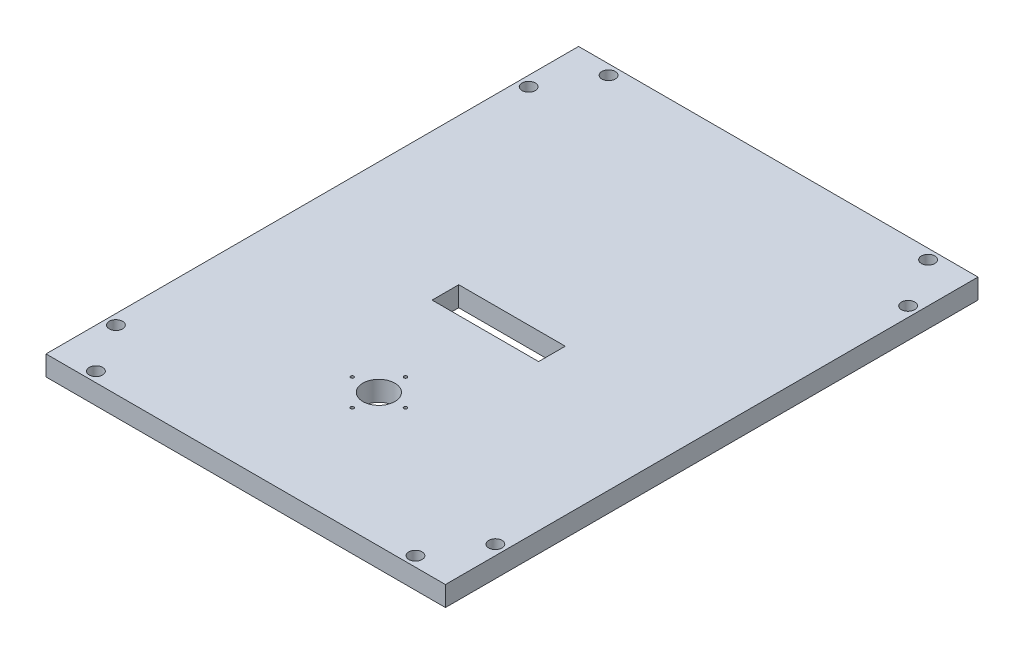
ISO-10303-21;
HEADER;
FILE_DESCRIPTION(('STEP AP214'),'2;1');
FILE_NAME('part.step','',(''),(''),'','','');
FILE_SCHEMA(('AUTOMOTIVE_DESIGN { 1 0 10303 214 1 1 1 1 }'));
ENDSEC;
DATA;
#1=APPLICATION_CONTEXT('core data for automotive mechanical design processes');
#2=APPLICATION_PROTOCOL_DEFINITION('international standard','automotive_design',2000,#1);
#3=PRODUCT_CONTEXT('',#1,'mechanical');
#4=PRODUCT('Part','Part','',(#3));
#5=PRODUCT_RELATED_PRODUCT_CATEGORY('part','',(#4));
#6=PRODUCT_DEFINITION_FORMATION('','',#4);
#7=PRODUCT_DEFINITION_CONTEXT('part definition',#1,'design');
#8=PRODUCT_DEFINITION('design','',#6,#7);
#9=PRODUCT_DEFINITION_SHAPE('','',#8);
#10=(LENGTH_UNIT() NAMED_UNIT(*) SI_UNIT(.MILLI.,.METRE.));
#11=(NAMED_UNIT(*) PLANE_ANGLE_UNIT() SI_UNIT($,.RADIAN.));
#12=(NAMED_UNIT(*) SI_UNIT($,.STERADIAN.) SOLID_ANGLE_UNIT());
#13=UNCERTAINTY_MEASURE_WITH_UNIT(LENGTH_MEASURE(1.E-05),#10,'distance_accuracy_value','');
#14=(GEOMETRIC_REPRESENTATION_CONTEXT(3) GLOBAL_UNCERTAINTY_ASSIGNED_CONTEXT((#13)) GLOBAL_UNIT_ASSIGNED_CONTEXT((#10,
#11,#12)) REPRESENTATION_CONTEXT('',''));
#15=CARTESIAN_POINT('',(0.,0.,0.));
#16=DIRECTION('',(0.,0.,1.));
#17=DIRECTION('',(1.,0.,0.));
#18=AXIS2_PLACEMENT_3D('',#15,#16,#17);
#19=CARTESIAN_POINT('',(0.,7.5,0.));
#20=DIRECTION('',(-1.,0.,0.));
#21=DIRECTION('',(0.,0.,1.));
#22=AXIS2_PLACEMENT_3D('',#19,#20,#21);
#23=PLANE('',#22);
#24=DIRECTION('',(0.,0.,-1.));
#25=VECTOR('',#24,1.);
#26=CARTESIAN_POINT('',(0.,0.,0.));
#27=LINE('',#26,#25);
#28=CARTESIAN_POINT('',(0.,0.,0.));
#29=VERTEX_POINT('',#28);
#30=CARTESIAN_POINT('',(0.,0.,-200.));
#31=VERTEX_POINT('',#30);
#32=EDGE_CURVE('E198',#29,#31,#27,.T.);
#33=ORIENTED_EDGE('',*,*,#32,.F.);
#34=DIRECTION('',(0.,-1.,0.));
#35=VECTOR('',#34,1.);
#36=CARTESIAN_POINT('',(0.,7.5,0.));
#37=LINE('',#36,#35);
#38=CARTESIAN_POINT('',(0.,7.5,0.));
#39=VERTEX_POINT('',#38);
#40=EDGE_CURVE('E11',#39,#29,#37,.T.);
#41=ORIENTED_EDGE('',*,*,#40,.F.);
#42=DIRECTION('',(0.,0.,-1.));
#43=VECTOR('',#42,1.);
#44=CARTESIAN_POINT('',(0.,7.5,0.));
#45=LINE('',#44,#43);
#46=CARTESIAN_POINT('',(0.,7.5,-200.));
#47=VERTEX_POINT('',#46);
#48=EDGE_CURVE('E136',#39,#47,#45,.T.);
#49=ORIENTED_EDGE('',*,*,#48,.T.);
#50=DIRECTION('',(0.,-1.,0.));
#51=VECTOR('',#50,1.);
#52=CARTESIAN_POINT('',(0.,7.5,-200.));
#53=LINE('',#52,#51);
#54=EDGE_CURVE('E67',#47,#31,#53,.T.);
#55=ORIENTED_EDGE('',*,*,#54,.T.);
#56=EDGE_LOOP('',(#33,#41,#49,#55));
#57=FACE_BOUND('',#56,.T.);
#58=ADVANCED_FACE('F47',(#57),#23,.T.);
#59=CARTESIAN_POINT('',(0.,7.5,0.));
#60=DIRECTION('',(0.,0.,-1.));
#61=DIRECTION('',(-1.,0.,0.));
#62=AXIS2_PLACEMENT_3D('',#59,#60,#61);
#63=PLANE('',#62);
#64=DIRECTION('',(1.,0.,0.));
#65=VECTOR('',#64,1.);
#66=CARTESIAN_POINT('',(0.,0.,0.));
#67=LINE('',#66,#65);
#68=CARTESIAN_POINT('',(150.,0.,0.));
#69=VERTEX_POINT('',#68);
#70=EDGE_CURVE('E142',#29,#69,#67,.T.);
#71=ORIENTED_EDGE('',*,*,#70,.T.);
#72=DIRECTION('',(0.,-1.,0.));
#73=VECTOR('',#72,1.);
#74=CARTESIAN_POINT('',(150.,7.5,0.));
#75=LINE('',#74,#73);
#76=CARTESIAN_POINT('',(150.,7.5,0.));
#77=VERTEX_POINT('',#76);
#78=EDGE_CURVE('E58',#77,#69,#75,.T.);
#79=ORIENTED_EDGE('',*,*,#78,.F.);
#80=DIRECTION('',(1.,0.,0.));
#81=VECTOR('',#80,1.);
#82=CARTESIAN_POINT('',(0.,7.5,0.));
#83=LINE('',#82,#81);
#84=EDGE_CURVE('E130',#39,#77,#83,.T.);
#85=ORIENTED_EDGE('',*,*,#84,.F.);
#86=ORIENTED_EDGE('',*,*,#40,.T.);
#87=EDGE_LOOP('',(#71,#79,#85,#86));
#88=FACE_BOUND('',#87,.T.);
#89=ADVANCED_FACE('F140',(#88),#63,.F.);
#90=CARTESIAN_POINT('',(150.,7.5,0.));
#91=DIRECTION('',(-1.,0.,0.));
#92=DIRECTION('',(0.,0.,1.));
#93=AXIS2_PLACEMENT_3D('',#90,#91,#92);
#94=PLANE('',#93);
#95=DIRECTION('',(0.,0.,-1.));
#96=VECTOR('',#95,1.);
#97=CARTESIAN_POINT('',(150.,0.,0.));
#98=LINE('',#97,#96);
#99=CARTESIAN_POINT('',(150.,0.,-200.));
#100=VERTEX_POINT('',#99);
#101=EDGE_CURVE('E193',#69,#100,#98,.T.);
#102=ORIENTED_EDGE('',*,*,#101,.T.);
#103=DIRECTION('',(0.,-1.,0.));
#104=VECTOR('',#103,1.);
#105=CARTESIAN_POINT('',(150.,7.5,-200.));
#106=LINE('',#105,#104);
#107=CARTESIAN_POINT('',(150.,7.5,-200.));
#108=VERTEX_POINT('',#107);
#109=EDGE_CURVE('E93',#108,#100,#106,.T.);
#110=ORIENTED_EDGE('',*,*,#109,.F.);
#111=DIRECTION('',(0.,0.,-1.));
#112=VECTOR('',#111,1.);
#113=CARTESIAN_POINT('',(150.,7.5,0.));
#114=LINE('',#113,#112);
#115=EDGE_CURVE('E121',#77,#108,#114,.T.);
#116=ORIENTED_EDGE('',*,*,#115,.F.);
#117=ORIENTED_EDGE('',*,*,#78,.T.);
#118=EDGE_LOOP('',(#102,#110,#116,#117));
#119=FACE_BOUND('',#118,.T.);
#120=ADVANCED_FACE('F123',(#119),#94,.F.);
#121=CARTESIAN_POINT('',(55.,7.5,0.));
#122=DIRECTION('',(-1.,0.,0.));
#123=DIRECTION('',(0.,0.,1.));
#124=AXIS2_PLACEMENT_3D('',#121,#122,#123);
#125=PLANE('',#124);
#126=DIRECTION('',(0.,0.,-1.));
#127=VECTOR('',#126,1.);
#128=CARTESIAN_POINT('',(55.,0.,0.));
#129=LINE('',#128,#127);
#130=CARTESIAN_POINT('',(55.,0.,-90.));
#131=VERTEX_POINT('',#130);
#132=CARTESIAN_POINT('',(55.,0.,-100.));
#133=VERTEX_POINT('',#132);
#134=EDGE_CURVE('E210',#131,#133,#129,.T.);
#135=ORIENTED_EDGE('',*,*,#134,.T.);
#136=DIRECTION('',(0.,-1.,0.));
#137=VECTOR('',#136,1.);
#138=CARTESIAN_POINT('',(55.,7.5,-100.));
#139=LINE('',#138,#137);
#140=CARTESIAN_POINT('',(55.,7.5,-100.));
#141=VERTEX_POINT('',#140);
#142=EDGE_CURVE('E51',#141,#133,#139,.T.);
#143=ORIENTED_EDGE('',*,*,#142,.F.);
#144=DIRECTION('',(0.,0.,-1.));
#145=VECTOR('',#144,1.);
#146=CARTESIAN_POINT('',(55.,7.5,0.));
#147=LINE('',#146,#145);
#148=CARTESIAN_POINT('',(55.,7.5,-90.));
#149=VERTEX_POINT('',#148);
#150=EDGE_CURVE('E172',#149,#141,#147,.T.);
#151=ORIENTED_EDGE('',*,*,#150,.F.);
#152=DIRECTION('',(0.,-1.,0.));
#153=VECTOR('',#152,1.);
#154=CARTESIAN_POINT('',(55.,7.5,-90.));
#155=LINE('',#154,#153);
#156=EDGE_CURVE('E149',#149,#131,#155,.T.);
#157=ORIENTED_EDGE('',*,*,#156,.T.);
#158=EDGE_LOOP('',(#135,#143,#151,#157));
#159=FACE_BOUND('',#158,.T.);
#160=ADVANCED_FACE('F49',(#159),#125,.F.);
#161=CARTESIAN_POINT('',(0.,7.5,-100.));
#162=DIRECTION('',(0.,0.,-1.));
#163=DIRECTION('',(-1.,0.,0.));
#164=AXIS2_PLACEMENT_3D('',#161,#162,#163);
#165=PLANE('',#164);
#166=DIRECTION('',(1.,0.,0.));
#167=VECTOR('',#166,1.);
#168=CARTESIAN_POINT('',(0.,0.,-100.));
#169=LINE('',#168,#167);
#170=CARTESIAN_POINT('',(95.,0.,-100.));
#171=VERTEX_POINT('',#170);
#172=EDGE_CURVE('E207',#133,#171,#169,.T.);
#173=ORIENTED_EDGE('',*,*,#172,.T.);
#174=DIRECTION('',(0.,-1.,0.));
#175=VECTOR('',#174,1.);
#176=CARTESIAN_POINT('',(95.,7.5,-100.));
#177=LINE('',#176,#175);
#178=CARTESIAN_POINT('',(95.,7.5,-100.));
#179=VERTEX_POINT('',#178);
#180=EDGE_CURVE('E157',#179,#171,#177,.T.);
#181=ORIENTED_EDGE('',*,*,#180,.F.);
#182=DIRECTION('',(1.,0.,0.));
#183=VECTOR('',#182,1.);
#184=CARTESIAN_POINT('',(0.,7.5,-100.));
#185=LINE('',#184,#183);
#186=EDGE_CURVE('E106',#141,#179,#185,.T.);
#187=ORIENTED_EDGE('',*,*,#186,.F.);
#188=ORIENTED_EDGE('',*,*,#142,.T.);
#189=EDGE_LOOP('',(#173,#181,#187,#188));
#190=FACE_BOUND('',#189,.T.);
#191=ADVANCED_FACE('F365',(#190),#165,.F.);
#192=CARTESIAN_POINT('',(95.,7.5,0.));
#193=DIRECTION('',(1.,0.,0.));
#194=DIRECTION('',(0.,0.,-1.));
#195=AXIS2_PLACEMENT_3D('',#192,#193,#194);
#196=PLANE('',#195);
#197=DIRECTION('',(0.,0.,1.));
#198=VECTOR('',#197,1.);
#199=CARTESIAN_POINT('',(95.,0.,0.));
#200=LINE('',#199,#198);
#201=CARTESIAN_POINT('',(95.,0.,-90.));
#202=VERTEX_POINT('',#201);
#203=EDGE_CURVE('E204',#171,#202,#200,.T.);
#204=ORIENTED_EDGE('',*,*,#203,.T.);
#205=DIRECTION('',(0.,-1.,0.));
#206=VECTOR('',#205,1.);
#207=CARTESIAN_POINT('',(95.,7.5,-90.));
#208=LINE('',#207,#206);
#209=CARTESIAN_POINT('',(95.,7.5,-90.));
#210=VERTEX_POINT('',#209);
#211=EDGE_CURVE('E153',#210,#202,#208,.T.);
#212=ORIENTED_EDGE('',*,*,#211,.F.);
#213=DIRECTION('',(0.,0.,1.));
#214=VECTOR('',#213,1.);
#215=CARTESIAN_POINT('',(95.,7.5,0.));
#216=LINE('',#215,#214);
#217=EDGE_CURVE('E240',#179,#210,#216,.T.);
#218=ORIENTED_EDGE('',*,*,#217,.F.);
#219=ORIENTED_EDGE('',*,*,#180,.T.);
#220=EDGE_LOOP('',(#204,#212,#218,#219));
#221=FACE_BOUND('',#220,.T.);
#222=ADVANCED_FACE('F362',(#221),#196,.F.);
#223=CARTESIAN_POINT('',(85.,7.5,-50.));
#224=DIRECTION('',(0.,-1.,0.));
#225=DIRECTION('',(0.,0.,-1.));
#226=AXIS2_PLACEMENT_3D('',#223,#224,#225);
#227=CYLINDRICAL_SURFACE('',#226,0.600000000000008);
#228=CARTESIAN_POINT('',(85.,7.5,-50.));
#229=DIRECTION('',(0.,1.,0.));
#230=DIRECTION('',(0.,0.,1.));
#231=AXIS2_PLACEMENT_3D('',#228,#229,#230);
#232=CIRCLE('',#231,0.600000000000008);
#233=CARTESIAN_POINT('',(85.,7.5,-49.4));
#234=VERTEX_POINT('',#233);
#235=EDGE_CURVE('E217',#234,#234,#232,.T.);
#236=ORIENTED_EDGE('',*,*,#235,.T.);
#237=EDGE_LOOP('',(#236));
#238=FACE_BOUND('',#237,.T.);
#239=CARTESIAN_POINT('',(85.,0.,-50.));
#240=DIRECTION('',(0.,1.,0.));
#241=DIRECTION('',(0.,0.,1.));
#242=AXIS2_PLACEMENT_3D('',#239,#240,#241);
#243=CIRCLE('',#242,0.600000000000008);
#244=CARTESIAN_POINT('',(85.,0.,-49.4));
#245=VERTEX_POINT('',#244);
#246=EDGE_CURVE('E173',#245,#245,#243,.T.);
#247=ORIENTED_EDGE('',*,*,#246,.F.);
#248=EDGE_LOOP('',(#247));
#249=FACE_BOUND('',#248,.T.);
#250=ADVANCED_FACE('F364',(#238,#249),#227,.F.);
#251=CARTESIAN_POINT('',(75.,7.5,-40.));
#252=DIRECTION('',(0.,-1.,0.));
#253=DIRECTION('',(0.,0.,-1.));
#254=AXIS2_PLACEMENT_3D('',#251,#252,#253);
#255=CYLINDRICAL_SURFACE('',#254,0.600000000000008);
#256=CARTESIAN_POINT('',(75.,7.5,-40.));
#257=DIRECTION('',(0.,1.,0.));
#258=DIRECTION('',(0.,0.,1.));
#259=AXIS2_PLACEMENT_3D('',#256,#257,#258);
#260=CIRCLE('',#259,0.600000000000008);
#261=CARTESIAN_POINT('',(75.,7.5,-39.4));
#262=VERTEX_POINT('',#261);
#263=EDGE_CURVE('E221',#262,#262,#260,.T.);
#264=ORIENTED_EDGE('',*,*,#263,.T.);
#265=EDGE_LOOP('',(#264));
#266=FACE_BOUND('',#265,.T.);
#267=CARTESIAN_POINT('',(75.,0.,-40.));
#268=DIRECTION('',(0.,1.,0.));
#269=DIRECTION('',(0.,0.,1.));
#270=AXIS2_PLACEMENT_3D('',#267,#268,#269);
#271=CIRCLE('',#270,0.600000000000008);
#272=CARTESIAN_POINT('',(75.,0.,-39.4));
#273=VERTEX_POINT('',#272);
#274=EDGE_CURVE('E177',#273,#273,#271,.T.);
#275=ORIENTED_EDGE('',*,*,#274,.F.);
#276=EDGE_LOOP('',(#275));
#277=FACE_BOUND('',#276,.T.);
#278=ADVANCED_FACE('F391',(#266,#277),#255,.F.);
#279=CARTESIAN_POINT('',(65.,7.5,-50.0000000000001));
#280=DIRECTION('',(0.,-1.,0.));
#281=DIRECTION('',(0.,0.,-1.));
#282=AXIS2_PLACEMENT_3D('',#279,#280,#281);
#283=CYLINDRICAL_SURFACE('',#282,0.600000000000008);
#284=CARTESIAN_POINT('',(65.,7.5,-50.0000000000001));
#285=DIRECTION('',(0.,1.,0.));
#286=DIRECTION('',(0.,0.,1.));
#287=AXIS2_PLACEMENT_3D('',#284,#285,#286);
#288=CIRCLE('',#287,0.600000000000008);
#289=CARTESIAN_POINT('',(65.,7.5,-49.4000000000001));
#290=VERTEX_POINT('',#289);
#291=EDGE_CURVE('E225',#290,#290,#288,.T.);
#292=ORIENTED_EDGE('',*,*,#291,.T.);
#293=EDGE_LOOP('',(#292));
#294=FACE_BOUND('',#293,.T.);
#295=CARTESIAN_POINT('',(65.,0.,-50.0000000000001));
#296=DIRECTION('',(0.,1.,0.));
#297=DIRECTION('',(0.,0.,1.));
#298=AXIS2_PLACEMENT_3D('',#295,#296,#297);
#299=CIRCLE('',#298,0.600000000000008);
#300=CARTESIAN_POINT('',(65.,0.,-49.4000000000001));
#301=VERTEX_POINT('',#300);
#302=EDGE_CURVE('E181',#301,#301,#299,.T.);
#303=ORIENTED_EDGE('',*,*,#302,.F.);
#304=EDGE_LOOP('',(#303));
#305=FACE_BOUND('',#304,.T.);
#306=ADVANCED_FACE('F387',(#294,#305),#283,.F.);
#307=CARTESIAN_POINT('',(75.0000000000001,7.5,-60.));
#308=DIRECTION('',(0.,-1.,0.));
#309=DIRECTION('',(0.,0.,-1.));
#310=AXIS2_PLACEMENT_3D('',#307,#308,#309);
#311=CYLINDRICAL_SURFACE('',#310,0.600000000000008);
#312=CARTESIAN_POINT('',(75.0000000000001,7.5,-60.));
#313=DIRECTION('',(0.,1.,0.));
#314=DIRECTION('',(0.,0.,1.));
#315=AXIS2_PLACEMENT_3D('',#312,#313,#314);
#316=CIRCLE('',#315,0.600000000000008);
#317=CARTESIAN_POINT('',(75.0000000000001,7.5,-59.4));
#318=VERTEX_POINT('',#317);
#319=EDGE_CURVE('E229',#318,#318,#316,.T.);
#320=ORIENTED_EDGE('',*,*,#319,.T.);
#321=EDGE_LOOP('',(#320));
#322=FACE_BOUND('',#321,.T.);
#323=CARTESIAN_POINT('',(75.0000000000001,0.,-60.));
#324=DIRECTION('',(0.,1.,0.));
#325=DIRECTION('',(0.,0.,1.));
#326=AXIS2_PLACEMENT_3D('',#323,#324,#325);
#327=CIRCLE('',#326,0.600000000000008);
#328=CARTESIAN_POINT('',(75.0000000000001,0.,-59.4));
#329=VERTEX_POINT('',#328);
#330=EDGE_CURVE('E185',#329,#329,#327,.T.);
#331=ORIENTED_EDGE('',*,*,#330,.F.);
#332=EDGE_LOOP('',(#331));
#333=FACE_BOUND('',#332,.T.);
#334=ADVANCED_FACE('F384',(#322,#333),#311,.F.);
#335=CARTESIAN_POINT('',(0.,7.5,-200.));
#336=DIRECTION('',(0.,0.,-1.));
#337=DIRECTION('',(-1.,0.,0.));
#338=AXIS2_PLACEMENT_3D('',#335,#336,#337);
#339=PLANE('',#338);
#340=DIRECTION('',(1.,0.,0.));
#341=VECTOR('',#340,1.);
#342=CARTESIAN_POINT('',(0.,0.,-200.));
#343=LINE('',#342,#341);
#344=EDGE_CURVE('E189',#31,#100,#343,.T.);
#345=ORIENTED_EDGE('',*,*,#344,.F.);
#346=ORIENTED_EDGE('',*,*,#54,.F.);
#347=DIRECTION('',(1.,0.,0.));
#348=VECTOR('',#347,1.);
#349=CARTESIAN_POINT('',(0.,7.5,-200.));
#350=LINE('',#349,#348);
#351=EDGE_CURVE('E129',#47,#108,#350,.T.);
#352=ORIENTED_EDGE('',*,*,#351,.T.);
#353=ORIENTED_EDGE('',*,*,#109,.T.);
#354=EDGE_LOOP('',(#345,#346,#352,#353));
#355=FACE_BOUND('',#354,.T.);
#356=ADVANCED_FACE('F350',(#355),#339,.T.);
#357=CARTESIAN_POINT('',(0.,7.5,-90.));
#358=DIRECTION('',(0.,0.,1.));
#359=DIRECTION('',(1.,0.,0.));
#360=AXIS2_PLACEMENT_3D('',#357,#358,#359);
#361=PLANE('',#360);
#362=DIRECTION('',(-1.,0.,0.));
#363=VECTOR('',#362,1.);
#364=CARTESIAN_POINT('',(0.,0.,-90.));
#365=LINE('',#364,#363);
#366=EDGE_CURVE('E201',#202,#131,#365,.T.);
#367=ORIENTED_EDGE('',*,*,#366,.T.);
#368=ORIENTED_EDGE('',*,*,#156,.F.);
#369=DIRECTION('',(-1.,0.,0.));
#370=VECTOR('',#369,1.);
#371=CARTESIAN_POINT('',(0.,7.5,-90.));
#372=LINE('',#371,#370);
#373=EDGE_CURVE('E237',#210,#149,#372,.T.);
#374=ORIENTED_EDGE('',*,*,#373,.F.);
#375=ORIENTED_EDGE('',*,*,#211,.T.);
#376=EDGE_LOOP('',(#367,#368,#374,#375));
#377=FACE_BOUND('',#376,.T.);
#378=ADVANCED_FACE('F341',(#377),#361,.F.);
#379=CARTESIAN_POINT('',(75.,7.5,-50.));
#380=DIRECTION('',(0.,-1.,0.));
#381=DIRECTION('',(0.,0.,-1.));
#382=AXIS2_PLACEMENT_3D('',#379,#380,#381);
#383=CYLINDRICAL_SURFACE('',#382,6.);
#384=CARTESIAN_POINT('',(75.,7.5,-50.));
#385=DIRECTION('',(0.,1.,0.));
#386=DIRECTION('',(0.,0.,1.));
#387=AXIS2_PLACEMENT_3D('',#384,#385,#386);
#388=CIRCLE('',#387,6.);
#389=CARTESIAN_POINT('',(75.,7.5,-44.));
#390=VERTEX_POINT('',#389);
#391=EDGE_CURVE('E154',#390,#390,#388,.T.);
#392=ORIENTED_EDGE('',*,*,#391,.T.);
#393=EDGE_LOOP('',(#392));
#394=FACE_BOUND('',#393,.T.);
#395=CARTESIAN_POINT('',(75.,0.,-50.));
#396=DIRECTION('',(0.,1.,0.));
#397=DIRECTION('',(0.,0.,1.));
#398=AXIS2_PLACEMENT_3D('',#395,#396,#397);
#399=CIRCLE('',#398,6.);
#400=CARTESIAN_POINT('',(75.,0.,-44.));
#401=VERTEX_POINT('',#400);
#402=EDGE_CURVE('E168',#401,#401,#399,.T.);
#403=ORIENTED_EDGE('',*,*,#402,.F.);
#404=EDGE_LOOP('',(#403));
#405=FACE_BOUND('',#404,.T.);
#406=ADVANCED_FACE('F339',(#394,#405),#383,.F.);
#407=CARTESIAN_POINT('',(0.,7.5,0.));
#408=DIRECTION('',(0.,1.,0.));
#409=DIRECTION('',(0.,0.,1.));
#410=AXIS2_PLACEMENT_3D('',#407,#408,#409);
#411=PLANE('',#410);
#412=CARTESIAN_POINT('',(146.25,7.5,-177.5));
#413=DIRECTION('',(0.,-1.,0.));
#414=DIRECTION('',(0.,0.,1.));
#415=AXIS2_PLACEMENT_3D('',#412,#413,#414);
#416=CIRCLE('',#415,2.5);
#417=CARTESIAN_POINT('',(146.25,7.5,-175.));
#418=VERTEX_POINT('',#417);
#419=EDGE_CURVE('E271',#418,#418,#416,.T.);
#420=ORIENTED_EDGE('',*,*,#419,.T.);
#421=EDGE_LOOP('',(#420));
#422=FACE_BOUND('',#421,.T.);
#423=CARTESIAN_POINT('',(15.,7.5,-3.75));
#424=DIRECTION('',(0.,-1.,0.));
#425=DIRECTION('',(0.,0.,1.));
#426=AXIS2_PLACEMENT_3D('',#423,#424,#425);
#427=CIRCLE('',#426,2.5);
#428=CARTESIAN_POINT('',(15.,7.5,-1.25000000000001));
#429=VERTEX_POINT('',#428);
#430=EDGE_CURVE('E280',#429,#429,#427,.T.);
#431=ORIENTED_EDGE('',*,*,#430,.T.);
#432=EDGE_LOOP('',(#431));
#433=FACE_BOUND('',#432,.T.);
#434=CARTESIAN_POINT('',(3.75,7.5,-22.5));
#435=DIRECTION('',(0.,-1.,0.));
#436=DIRECTION('',(0.,0.,1.));
#437=AXIS2_PLACEMENT_3D('',#434,#435,#436);
#438=CIRCLE('',#437,2.5);
#439=CARTESIAN_POINT('',(3.75,7.5,-20.));
#440=VERTEX_POINT('',#439);
#441=EDGE_CURVE('E255',#440,#440,#438,.T.);
#442=ORIENTED_EDGE('',*,*,#441,.T.);
#443=EDGE_LOOP('',(#442));
#444=FACE_BOUND('',#443,.T.);
#445=CARTESIAN_POINT('',(146.25,7.5,-22.5));
#446=DIRECTION('',(0.,-1.,0.));
#447=DIRECTION('',(0.,0.,-1.));
#448=AXIS2_PLACEMENT_3D('',#445,#446,#447);
#449=CIRCLE('',#448,2.5);
#450=CARTESIAN_POINT('',(146.25,7.5,-25.));
#451=VERTEX_POINT('',#450);
#452=EDGE_CURVE('E264',#451,#451,#449,.T.);
#453=ORIENTED_EDGE('',*,*,#452,.T.);
#454=EDGE_LOOP('',(#453));
#455=FACE_BOUND('',#454,.T.);
#456=CARTESIAN_POINT('',(15.,7.5,-196.25));
#457=DIRECTION('',(0.,-1.,0.));
#458=DIRECTION('',(0.,0.,-1.));
#459=AXIS2_PLACEMENT_3D('',#456,#457,#458);
#460=CIRCLE('',#459,2.5);
#461=CARTESIAN_POINT('',(15.,7.5,-198.75));
#462=VERTEX_POINT('',#461);
#463=EDGE_CURVE('E303',#462,#462,#460,.T.);
#464=ORIENTED_EDGE('',*,*,#463,.T.);
#465=EDGE_LOOP('',(#464));
#466=FACE_BOUND('',#465,.T.);
#467=CARTESIAN_POINT('',(3.75,7.5,-177.5));
#468=DIRECTION('',(0.,-1.,0.));
#469=DIRECTION('',(0.,0.,-1.));
#470=AXIS2_PLACEMENT_3D('',#467,#468,#469);
#471=CIRCLE('',#470,2.5);
#472=CARTESIAN_POINT('',(3.75,7.5,-180.));
#473=VERTEX_POINT('',#472);
#474=EDGE_CURVE('E287',#473,#473,#471,.T.);
#475=ORIENTED_EDGE('',*,*,#474,.T.);
#476=EDGE_LOOP('',(#475));
#477=FACE_BOUND('',#476,.T.);
#478=CARTESIAN_POINT('',(135.,7.5,-196.25));
#479=DIRECTION('',(0.,-1.,0.));
#480=DIRECTION('',(0.,0.,1.));
#481=AXIS2_PLACEMENT_3D('',#478,#479,#480);
#482=CIRCLE('',#481,2.5);
#483=CARTESIAN_POINT('',(135.,7.5,-193.75));
#484=VERTEX_POINT('',#483);
#485=EDGE_CURVE('E296',#484,#484,#482,.T.);
#486=ORIENTED_EDGE('',*,*,#485,.T.);
#487=EDGE_LOOP('',(#486));
#488=FACE_BOUND('',#487,.T.);
#489=CARTESIAN_POINT('',(135.,7.5,-3.75));
#490=DIRECTION('',(0.,-1.,0.));
#491=DIRECTION('',(0.,0.,-1.));
#492=AXIS2_PLACEMENT_3D('',#489,#490,#491);
#493=CIRCLE('',#492,2.5);
#494=CARTESIAN_POINT('',(135.,7.5,-6.25));
#495=VERTEX_POINT('',#494);
#496=EDGE_CURVE('E213',#495,#495,#493,.T.);
#497=ORIENTED_EDGE('',*,*,#496,.T.);
#498=EDGE_LOOP('',(#497));
#499=FACE_BOUND('',#498,.T.);
#500=ORIENTED_EDGE('',*,*,#150,.T.);
#501=ORIENTED_EDGE('',*,*,#186,.T.);
#502=ORIENTED_EDGE('',*,*,#217,.T.);
#503=ORIENTED_EDGE('',*,*,#373,.T.);
#504=EDGE_LOOP('',(#500,#501,#502,#503));
#505=FACE_BOUND('',#504,.T.);
#506=ORIENTED_EDGE('',*,*,#48,.F.);
#507=ORIENTED_EDGE('',*,*,#84,.T.);
#508=ORIENTED_EDGE('',*,*,#115,.T.);
#509=ORIENTED_EDGE('',*,*,#351,.F.);
#510=EDGE_LOOP('',(#506,#507,#508,#509));
#511=FACE_BOUND('',#510,.T.);
#512=ORIENTED_EDGE('',*,*,#319,.F.);
#513=EDGE_LOOP('',(#512));
#514=FACE_BOUND('',#513,.T.);
#515=ORIENTED_EDGE('',*,*,#291,.F.);
#516=EDGE_LOOP('',(#515));
#517=FACE_BOUND('',#516,.T.);
#518=ORIENTED_EDGE('',*,*,#263,.F.);
#519=EDGE_LOOP('',(#518));
#520=FACE_BOUND('',#519,.T.);
#521=ORIENTED_EDGE('',*,*,#235,.F.);
#522=EDGE_LOOP('',(#521));
#523=FACE_BOUND('',#522,.T.);
#524=ORIENTED_EDGE('',*,*,#391,.F.);
#525=EDGE_LOOP('',(#524));
#526=FACE_BOUND('',#525,.T.);
#527=ADVANCED_FACE('F134',(#422,#433,#444,#455,#466,#477,#488,#499,#505,#511,#514,#517,#520,
#523,#526),#411,.T.);
#528=CARTESIAN_POINT('',(0.,0.,0.));
#529=DIRECTION('',(0.,1.,0.));
#530=DIRECTION('',(0.,0.,1.));
#531=AXIS2_PLACEMENT_3D('',#528,#529,#530);
#532=PLANE('',#531);
#533=CARTESIAN_POINT('',(146.25,0.,-177.5));
#534=DIRECTION('',(0.,-1.,0.));
#535=DIRECTION('',(0.,0.,1.));
#536=AXIS2_PLACEMENT_3D('',#533,#534,#535);
#537=CIRCLE('',#536,2.5);
#538=CARTESIAN_POINT('',(146.25,0.,-175.));
#539=VERTEX_POINT('',#538);
#540=EDGE_CURVE('E275',#539,#539,#537,.T.);
#541=ORIENTED_EDGE('',*,*,#540,.F.);
#542=EDGE_LOOP('',(#541));
#543=FACE_BOUND('',#542,.T.);
#544=CARTESIAN_POINT('',(15.,0.,-3.75));
#545=DIRECTION('',(0.,-1.,0.));
#546=DIRECTION('',(0.,0.,1.));
#547=AXIS2_PLACEMENT_3D('',#544,#545,#546);
#548=CIRCLE('',#547,2.5);
#549=CARTESIAN_POINT('',(15.,0.,-1.25000000000001));
#550=VERTEX_POINT('',#549);
#551=EDGE_CURVE('E260',#550,#550,#548,.T.);
#552=ORIENTED_EDGE('',*,*,#551,.F.);
#553=EDGE_LOOP('',(#552));
#554=FACE_BOUND('',#553,.T.);
#555=CARTESIAN_POINT('',(3.75,0.,-22.5));
#556=DIRECTION('',(0.,-1.,0.));
#557=DIRECTION('',(0.,0.,1.));
#558=AXIS2_PLACEMENT_3D('',#555,#556,#557);
#559=CIRCLE('',#558,2.5);
#560=CARTESIAN_POINT('',(3.75,0.,-20.));
#561=VERTEX_POINT('',#560);
#562=EDGE_CURVE('E259',#561,#561,#559,.T.);
#563=ORIENTED_EDGE('',*,*,#562,.F.);
#564=EDGE_LOOP('',(#563));
#565=FACE_BOUND('',#564,.T.);
#566=CARTESIAN_POINT('',(146.25,0.,-22.5));
#567=DIRECTION('',(0.,-1.,0.));
#568=DIRECTION('',(0.,0.,-1.));
#569=AXIS2_PLACEMENT_3D('',#566,#567,#568);
#570=CIRCLE('',#569,2.5);
#571=CARTESIAN_POINT('',(146.25,0.,-25.));
#572=VERTEX_POINT('',#571);
#573=EDGE_CURVE('E251',#572,#572,#570,.T.);
#574=ORIENTED_EDGE('',*,*,#573,.F.);
#575=EDGE_LOOP('',(#574));
#576=FACE_BOUND('',#575,.T.);
#577=CARTESIAN_POINT('',(15.,0.,-196.25));
#578=DIRECTION('',(0.,-1.,0.));
#579=DIRECTION('',(0.,0.,-1.));
#580=AXIS2_PLACEMENT_3D('',#577,#578,#579);
#581=CIRCLE('',#580,2.5);
#582=CARTESIAN_POINT('',(15.,0.,-198.75));
#583=VERTEX_POINT('',#582);
#584=EDGE_CURVE('E292',#583,#583,#581,.T.);
#585=ORIENTED_EDGE('',*,*,#584,.F.);
#586=EDGE_LOOP('',(#585));
#587=FACE_BOUND('',#586,.T.);
#588=CARTESIAN_POINT('',(3.75,0.,-177.5));
#589=DIRECTION('',(0.,-1.,0.));
#590=DIRECTION('',(0.,0.,-1.));
#591=AXIS2_PLACEMENT_3D('',#588,#589,#590);
#592=CIRCLE('',#591,2.5);
#593=CARTESIAN_POINT('',(3.75,0.,-180.));
#594=VERTEX_POINT('',#593);
#595=EDGE_CURVE('E291',#594,#594,#592,.T.);
#596=ORIENTED_EDGE('',*,*,#595,.F.);
#597=EDGE_LOOP('',(#596));
#598=FACE_BOUND('',#597,.T.);
#599=CARTESIAN_POINT('',(135.,0.,-196.25));
#600=DIRECTION('',(0.,-1.,0.));
#601=DIRECTION('',(0.,0.,1.));
#602=AXIS2_PLACEMENT_3D('',#599,#600,#601);
#603=CIRCLE('',#602,2.5);
#604=CARTESIAN_POINT('',(135.,0.,-193.75));
#605=VERTEX_POINT('',#604);
#606=EDGE_CURVE('E276',#605,#605,#603,.T.);
#607=ORIENTED_EDGE('',*,*,#606,.F.);
#608=EDGE_LOOP('',(#607));
#609=FACE_BOUND('',#608,.T.);
#610=CARTESIAN_POINT('',(135.,0.,-3.75));
#611=DIRECTION('',(0.,-1.,0.));
#612=DIRECTION('',(0.,0.,-1.));
#613=AXIS2_PLACEMENT_3D('',#610,#611,#612);
#614=CIRCLE('',#613,2.5);
#615=CARTESIAN_POINT('',(135.,0.,-6.25));
#616=VERTEX_POINT('',#615);
#617=EDGE_CURVE('E247',#616,#616,#614,.T.);
#618=ORIENTED_EDGE('',*,*,#617,.F.);
#619=EDGE_LOOP('',(#618));
#620=FACE_BOUND('',#619,.T.);
#621=ORIENTED_EDGE('',*,*,#134,.F.);
#622=ORIENTED_EDGE('',*,*,#366,.F.);
#623=ORIENTED_EDGE('',*,*,#203,.F.);
#624=ORIENTED_EDGE('',*,*,#172,.F.);
#625=EDGE_LOOP('',(#621,#622,#623,#624));
#626=FACE_BOUND('',#625,.T.);
#627=ORIENTED_EDGE('',*,*,#32,.T.);
#628=ORIENTED_EDGE('',*,*,#344,.T.);
#629=ORIENTED_EDGE('',*,*,#101,.F.);
#630=ORIENTED_EDGE('',*,*,#70,.F.);
#631=EDGE_LOOP('',(#627,#628,#629,#630));
#632=FACE_BOUND('',#631,.T.);
#633=ORIENTED_EDGE('',*,*,#330,.T.);
#634=EDGE_LOOP('',(#633));
#635=FACE_BOUND('',#634,.T.);
#636=ORIENTED_EDGE('',*,*,#302,.T.);
#637=EDGE_LOOP('',(#636));
#638=FACE_BOUND('',#637,.T.);
#639=ORIENTED_EDGE('',*,*,#274,.T.);
#640=EDGE_LOOP('',(#639));
#641=FACE_BOUND('',#640,.T.);
#642=ORIENTED_EDGE('',*,*,#246,.T.);
#643=EDGE_LOOP('',(#642));
#644=FACE_BOUND('',#643,.T.);
#645=ORIENTED_EDGE('',*,*,#402,.T.);
#646=EDGE_LOOP('',(#645));
#647=FACE_BOUND('',#646,.T.);
#648=ADVANCED_FACE('F313',(#543,#554,#565,#576,#587,#598,#609,#620,#626,#632,#635,#638,#641,
#644,#647),#532,.F.);
#649=CARTESIAN_POINT('',(135.,7.5,-3.75));
#650=DIRECTION('',(0.,-1.,0.));
#651=DIRECTION('',(0.,0.,-1.));
#652=AXIS2_PLACEMENT_3D('',#649,#650,#651);
#653=CYLINDRICAL_SURFACE('',#652,2.5);
#654=ORIENTED_EDGE('',*,*,#496,.F.);
#655=EDGE_LOOP('',(#654));
#656=FACE_BOUND('',#655,.T.);
#657=ORIENTED_EDGE('',*,*,#617,.T.);
#658=EDGE_LOOP('',(#657));
#659=FACE_BOUND('',#658,.T.);
#660=ADVANCED_FACE('F316',(#656,#659),#653,.F.);
#661=CARTESIAN_POINT('',(135.,7.5,-196.25));
#662=DIRECTION('',(0.,-1.,0.));
#663=DIRECTION('',(0.,0.,-1.));
#664=AXIS2_PLACEMENT_3D('',#661,#662,#663);
#665=CYLINDRICAL_SURFACE('',#664,2.5);
#666=ORIENTED_EDGE('',*,*,#485,.F.);
#667=EDGE_LOOP('',(#666));
#668=FACE_BOUND('',#667,.T.);
#669=ORIENTED_EDGE('',*,*,#606,.T.);
#670=EDGE_LOOP('',(#669));
#671=FACE_BOUND('',#670,.T.);
#672=ADVANCED_FACE('F457',(#668,#671),#665,.F.);
#673=CARTESIAN_POINT('',(3.75,7.5,-177.5));
#674=DIRECTION('',(0.,-1.,0.));
#675=DIRECTION('',(0.,0.,-1.));
#676=AXIS2_PLACEMENT_3D('',#673,#674,#675);
#677=CYLINDRICAL_SURFACE('',#676,2.5);
#678=ORIENTED_EDGE('',*,*,#474,.F.);
#679=EDGE_LOOP('',(#678));
#680=FACE_BOUND('',#679,.T.);
#681=ORIENTED_EDGE('',*,*,#595,.T.);
#682=EDGE_LOOP('',(#681));
#683=FACE_BOUND('',#682,.T.);
#684=ADVANCED_FACE('F468',(#680,#683),#677,.F.);
#685=CARTESIAN_POINT('',(15.,7.5,-196.25));
#686=DIRECTION('',(0.,-1.,0.));
#687=DIRECTION('',(0.,0.,-1.));
#688=AXIS2_PLACEMENT_3D('',#685,#686,#687);
#689=CYLINDRICAL_SURFACE('',#688,2.5);
#690=ORIENTED_EDGE('',*,*,#463,.F.);
#691=EDGE_LOOP('',(#690));
#692=FACE_BOUND('',#691,.T.);
#693=ORIENTED_EDGE('',*,*,#584,.T.);
#694=EDGE_LOOP('',(#693));
#695=FACE_BOUND('',#694,.T.);
#696=ADVANCED_FACE('F311',(#692,#695),#689,.F.);
#697=CARTESIAN_POINT('',(146.25,7.5,-22.5));
#698=DIRECTION('',(0.,-1.,0.));
#699=DIRECTION('',(0.,0.,-1.));
#700=AXIS2_PLACEMENT_3D('',#697,#698,#699);
#701=CYLINDRICAL_SURFACE('',#700,2.5);
#702=ORIENTED_EDGE('',*,*,#452,.F.);
#703=EDGE_LOOP('',(#702));
#704=FACE_BOUND('',#703,.T.);
#705=ORIENTED_EDGE('',*,*,#573,.T.);
#706=EDGE_LOOP('',(#705));
#707=FACE_BOUND('',#706,.T.);
#708=ADVANCED_FACE('F489',(#704,#707),#701,.F.);
#709=CARTESIAN_POINT('',(3.75,7.5,-22.5));
#710=DIRECTION('',(0.,-1.,0.));
#711=DIRECTION('',(0.,0.,-1.));
#712=AXIS2_PLACEMENT_3D('',#709,#710,#711);
#713=CYLINDRICAL_SURFACE('',#712,2.5);
#714=ORIENTED_EDGE('',*,*,#441,.F.);
#715=EDGE_LOOP('',(#714));
#716=FACE_BOUND('',#715,.T.);
#717=ORIENTED_EDGE('',*,*,#562,.T.);
#718=EDGE_LOOP('',(#717));
#719=FACE_BOUND('',#718,.T.);
#720=ADVANCED_FACE('F500',(#716,#719),#713,.F.);
#721=CARTESIAN_POINT('',(15.,7.5,-3.75));
#722=DIRECTION('',(0.,-1.,0.));
#723=DIRECTION('',(0.,0.,-1.));
#724=AXIS2_PLACEMENT_3D('',#721,#722,#723);
#725=CYLINDRICAL_SURFACE('',#724,2.5);
#726=ORIENTED_EDGE('',*,*,#430,.F.);
#727=EDGE_LOOP('',(#726));
#728=FACE_BOUND('',#727,.T.);
#729=ORIENTED_EDGE('',*,*,#551,.T.);
#730=EDGE_LOOP('',(#729));
#731=FACE_BOUND('',#730,.T.);
#732=ADVANCED_FACE('F511',(#728,#731),#725,.F.);
#733=CARTESIAN_POINT('',(146.25,7.5,-177.5));
#734=DIRECTION('',(0.,-1.,0.));
#735=DIRECTION('',(0.,0.,-1.));
#736=AXIS2_PLACEMENT_3D('',#733,#734,#735);
#737=CYLINDRICAL_SURFACE('',#736,2.5);
#738=ORIENTED_EDGE('',*,*,#419,.F.);
#739=EDGE_LOOP('',(#738));
#740=FACE_BOUND('',#739,.T.);
#741=ORIENTED_EDGE('',*,*,#540,.T.);
#742=EDGE_LOOP('',(#741));
#743=FACE_BOUND('',#742,.T.);
#744=ADVANCED_FACE('F522',(#740,#743),#737,.F.);
#745=CLOSED_SHELL('',(#58,#89,#120,#160,#191,#222,#250,#278,#306,#334,#356,#378,#406,#527,#648,
#660,#672,#684,#696,#708,#720,#732,#744));
#746=MANIFOLD_SOLID_BREP('B2',#745);
#747=ADVANCED_BREP_SHAPE_REPRESENTATION('',(#18,#746),#14);
#748=SHAPE_DEFINITION_REPRESENTATION(#9,#747);
ENDSEC;
END-ISO-10303-21;
